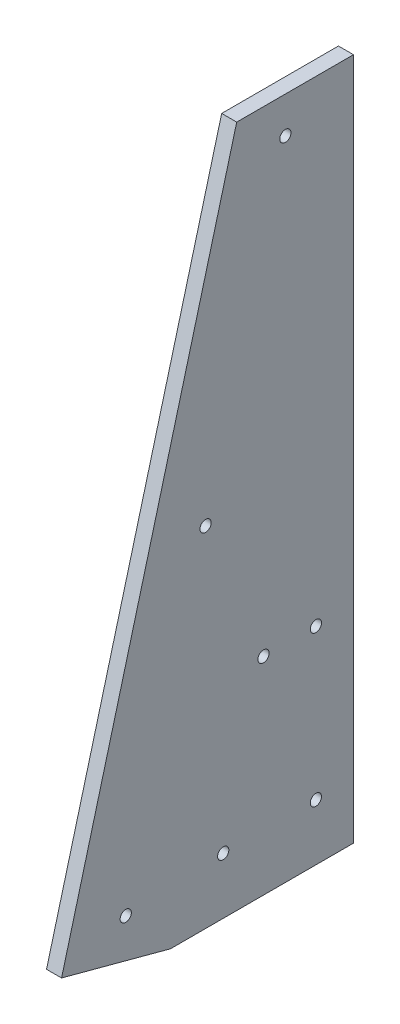
ISO-10303-21;
HEADER;
FILE_DESCRIPTION(('STEP AP214'),'2;1');
FILE_NAME('part.step','',(''),(''),'','','');
FILE_SCHEMA(('AUTOMOTIVE_DESIGN { 1 0 10303 214 1 1 1 1 }'));
ENDSEC;
DATA;
#1=APPLICATION_CONTEXT('core data for automotive mechanical design processes');
#2=APPLICATION_PROTOCOL_DEFINITION('international standard','automotive_design',2000,#1);
#3=PRODUCT_CONTEXT('',#1,'mechanical');
#4=PRODUCT('Part','Part','',(#3));
#5=PRODUCT_RELATED_PRODUCT_CATEGORY('part','',(#4));
#6=PRODUCT_DEFINITION_FORMATION('','',#4);
#7=PRODUCT_DEFINITION_CONTEXT('part definition',#1,'design');
#8=PRODUCT_DEFINITION('design','',#6,#7);
#9=PRODUCT_DEFINITION_SHAPE('','',#8);
#10=(LENGTH_UNIT() NAMED_UNIT(*) SI_UNIT(.MILLI.,.METRE.));
#11=(NAMED_UNIT(*) PLANE_ANGLE_UNIT() SI_UNIT($,.RADIAN.));
#12=(NAMED_UNIT(*) SI_UNIT($,.STERADIAN.) SOLID_ANGLE_UNIT());
#13=UNCERTAINTY_MEASURE_WITH_UNIT(LENGTH_MEASURE(1.E-05),#10,'distance_accuracy_value','');
#14=(GEOMETRIC_REPRESENTATION_CONTEXT(3) GLOBAL_UNCERTAINTY_ASSIGNED_CONTEXT((#13)) GLOBAL_UNIT_ASSIGNED_CONTEXT((#10,
#11,#12)) REPRESENTATION_CONTEXT('',''));
#15=CARTESIAN_POINT('',(0.,0.,0.));
#16=DIRECTION('',(0.,0.,1.));
#17=DIRECTION('',(1.,0.,0.));
#18=AXIS2_PLACEMENT_3D('',#15,#16,#17);
#19=CARTESIAN_POINT('',(5.08,0.,-61.8082822024453));
#20=DIRECTION('',(0.,1.,0.));
#21=DIRECTION('',(0.,0.,1.));
#22=AXIS2_PLACEMENT_3D('',#19,#20,#21);
#23=PLANE('',#22);
#24=DIRECTION('',(0.,0.,-1.));
#25=VECTOR('',#24,1.);
#26=CARTESIAN_POINT('',(0.,0.,-61.8082822024453));
#27=LINE('',#26,#25);
#28=CARTESIAN_POINT('',(0.,0.,0.));
#29=VERTEX_POINT('',#28);
#30=CARTESIAN_POINT('',(0.,0.,-61.8082822024453));
#31=VERTEX_POINT('',#30);
#32=EDGE_CURVE('E107',#29,#31,#27,.T.);
#33=ORIENTED_EDGE('',*,*,#32,.T.);
#34=DIRECTION('',(-1.,0.,0.));
#35=VECTOR('',#34,1.);
#36=CARTESIAN_POINT('',(5.08,0.,-61.8082822024453));
#37=LINE('',#36,#35);
#38=CARTESIAN_POINT('',(5.08,0.,-61.8082822024453));
#39=VERTEX_POINT('',#38);
#40=EDGE_CURVE('E11',#39,#31,#37,.T.);
#41=ORIENTED_EDGE('',*,*,#40,.F.);
#42=DIRECTION('',(0.,0.,-1.));
#43=VECTOR('',#42,1.);
#44=CARTESIAN_POINT('',(5.08,0.,-61.8082822024453));
#45=LINE('',#44,#43);
#46=CARTESIAN_POINT('',(5.08,0.,0.));
#47=VERTEX_POINT('',#46);
#48=EDGE_CURVE('E116',#47,#39,#45,.T.);
#49=ORIENTED_EDGE('',*,*,#48,.F.);
#50=DIRECTION('',(-1.,0.,0.));
#51=VECTOR('',#50,1.);
#52=CARTESIAN_POINT('',(5.08,0.,0.));
#53=LINE('',#52,#51);
#54=EDGE_CURVE('E103',#47,#29,#53,.T.);
#55=ORIENTED_EDGE('',*,*,#54,.T.);
#56=EDGE_LOOP('',(#33,#41,#49,#55));
#57=FACE_BOUND('',#56,.T.);
#58=ADVANCED_FACE('F33',(#57),#23,.F.);
#59=CARTESIAN_POINT('',(5.08,230.671649508087,-61.8082822024453));
#60=DIRECTION('',(0.,0.,1.));
#61=DIRECTION('',(0.,-1.,0.));
#62=AXIS2_PLACEMENT_3D('',#59,#60,#61);
#63=PLANE('',#62);
#64=DIRECTION('',(0.,1.,0.));
#65=VECTOR('',#64,1.);
#66=CARTESIAN_POINT('',(0.,230.671649508087,-61.8082822024453));
#67=LINE('',#66,#65);
#68=CARTESIAN_POINT('',(0.,230.671649508087,-61.8082822024453));
#69=VERTEX_POINT('',#68);
#70=EDGE_CURVE('E110',#31,#69,#67,.T.);
#71=ORIENTED_EDGE('',*,*,#70,.T.);
#72=DIRECTION('',(-1.,0.,0.));
#73=VECTOR('',#72,1.);
#74=CARTESIAN_POINT('',(5.08,230.671649508087,-61.8082822024453));
#75=LINE('',#74,#73);
#76=CARTESIAN_POINT('',(5.08,230.671649508087,-61.8082822024453));
#77=VERTEX_POINT('',#76);
#78=EDGE_CURVE('E41',#77,#69,#75,.T.);
#79=ORIENTED_EDGE('',*,*,#78,.F.);
#80=DIRECTION('',(0.,1.,0.));
#81=VECTOR('',#80,1.);
#82=CARTESIAN_POINT('',(5.08,230.671649508087,-61.8082822024453));
#83=LINE('',#82,#81);
#84=EDGE_CURVE('E83',#39,#77,#83,.T.);
#85=ORIENTED_EDGE('',*,*,#84,.F.);
#86=ORIENTED_EDGE('',*,*,#40,.T.);
#87=EDGE_LOOP('',(#71,#79,#85,#86));
#88=FACE_BOUND('',#87,.T.);
#89=ADVANCED_FACE('F136',(#88),#63,.F.);
#90=CARTESIAN_POINT('',(5.08,230.671649508087,-22.3642597288212));
#91=DIRECTION('',(0.,-1.,0.));
#92=DIRECTION('',(0.,0.,-1.));
#93=AXIS2_PLACEMENT_3D('',#90,#91,#92);
#94=PLANE('',#93);
#95=DIRECTION('',(0.,0.,1.));
#96=VECTOR('',#95,1.);
#97=CARTESIAN_POINT('',(0.,230.671649508087,-22.3642597288212));
#98=LINE('',#97,#96);
#99=CARTESIAN_POINT('',(0.,230.671649508087,-22.3642597288212));
#100=VERTEX_POINT('',#99);
#101=EDGE_CURVE('E98',#69,#100,#98,.T.);
#102=ORIENTED_EDGE('',*,*,#101,.T.);
#103=DIRECTION('',(-1.,0.,0.));
#104=VECTOR('',#103,1.);
#105=CARTESIAN_POINT('',(5.08,230.671649508087,-22.3642597288212));
#106=LINE('',#105,#104);
#107=CARTESIAN_POINT('',(5.08,230.671649508087,-22.3642597288212));
#108=VERTEX_POINT('',#107);
#109=EDGE_CURVE('E95',#108,#100,#106,.T.);
#110=ORIENTED_EDGE('',*,*,#109,.F.);
#111=DIRECTION('',(0.,0.,1.));
#112=VECTOR('',#111,1.);
#113=CARTESIAN_POINT('',(5.08,230.671649508087,-22.3642597288212));
#114=LINE('',#113,#112);
#115=EDGE_CURVE('E87',#77,#108,#114,.T.);
#116=ORIENTED_EDGE('',*,*,#115,.F.);
#117=ORIENTED_EDGE('',*,*,#78,.T.);
#118=EDGE_LOOP('',(#102,#110,#116,#117));
#119=FACE_BOUND('',#118,.T.);
#120=ADVANCED_FACE('F96',(#119),#94,.F.);
#121=CARTESIAN_POINT('',(5.08,9.86100561840579,36.8017739816136));
#122=DIRECTION('',(0.,-0.258819045102514,-0.96592582628907));
#123=DIRECTION('',(0.,0.96592582628907,-0.258819045102514));
#124=AXIS2_PLACEMENT_3D('',#121,#122,#123);
#125=PLANE('',#124);
#126=DIRECTION('',(0.,-0.96592582628907,0.258819045102514));
#127=VECTOR('',#126,1.);
#128=CARTESIAN_POINT('',(0.,9.86100561840579,36.8017739816136));
#129=LINE('',#128,#127);
#130=CARTESIAN_POINT('',(0.,9.86100561840579,36.8017739816136));
#131=VERTEX_POINT('',#130);
#132=EDGE_CURVE('E69',#100,#131,#129,.T.);
#133=ORIENTED_EDGE('',*,*,#132,.T.);
#134=DIRECTION('',(-1.,0.,0.));
#135=VECTOR('',#134,1.);
#136=CARTESIAN_POINT('',(5.08,9.86100561840579,36.8017739816136));
#137=LINE('',#136,#135);
#138=CARTESIAN_POINT('',(5.08,9.86100561840579,36.8017739816136));
#139=VERTEX_POINT('',#138);
#140=EDGE_CURVE('E99',#139,#131,#137,.T.);
#141=ORIENTED_EDGE('',*,*,#140,.F.);
#142=DIRECTION('',(0.,-0.96592582628907,0.258819045102514));
#143=VECTOR('',#142,1.);
#144=CARTESIAN_POINT('',(5.08,9.86100561840579,36.8017739816136));
#145=LINE('',#144,#143);
#146=EDGE_CURVE('E91',#108,#139,#145,.T.);
#147=ORIENTED_EDGE('',*,*,#146,.F.);
#148=ORIENTED_EDGE('',*,*,#109,.T.);
#149=EDGE_LOOP('',(#133,#141,#147,#148));
#150=FACE_BOUND('',#149,.T.);
#151=ADVANCED_FACE('F101',(#150),#125,.F.);
#152=CARTESIAN_POINT('',(5.08,0.,0.));
#153=DIRECTION('',(0.,0.96592582628907,-0.258819045102514));
#154=DIRECTION('',(0.,0.258819045102514,0.96592582628907));
#155=AXIS2_PLACEMENT_3D('',#152,#153,#154);
#156=PLANE('',#155);
#157=DIRECTION('',(0.,-0.258819045102514,-0.96592582628907));
#158=VECTOR('',#157,1.);
#159=CARTESIAN_POINT('',(0.,0.,0.));
#160=LINE('',#159,#158);
#161=EDGE_CURVE('E75',#131,#29,#160,.T.);
#162=ORIENTED_EDGE('',*,*,#161,.T.);
#163=ORIENTED_EDGE('',*,*,#54,.F.);
#164=DIRECTION('',(0.,-0.258819045102514,-0.96592582628907));
#165=VECTOR('',#164,1.);
#166=CARTESIAN_POINT('',(5.08,0.,0.));
#167=LINE('',#166,#165);
#168=EDGE_CURVE('E49',#139,#47,#167,.T.);
#169=ORIENTED_EDGE('',*,*,#168,.F.);
#170=ORIENTED_EDGE('',*,*,#140,.T.);
#171=EDGE_LOOP('',(#162,#163,#169,#170));
#172=FACE_BOUND('',#171,.T.);
#173=ADVANCED_FACE('F124',(#172),#156,.F.);
#174=CARTESIAN_POINT('',(5.08,0.,0.));
#175=DIRECTION('',(1.,0.,0.));
#176=DIRECTION('',(0.,0.,-1.));
#177=AXIS2_PLACEMENT_3D('',#174,#175,#176);
#178=PLANE('',#177);
#179=CARTESIAN_POINT('',(5.08,218.404391514216,-38.7992690928313));
#180=DIRECTION('',(1.,0.,0.));
#181=DIRECTION('',(0.,0.,-1.));
#182=AXIS2_PLACEMENT_3D('',#179,#180,#181);
#183=CIRCLE('',#182,1.89864999999997);
#184=CARTESIAN_POINT('',(5.08,218.404391514216,-40.6979190928313));
#185=VERTEX_POINT('',#184);
#186=EDGE_CURVE('E248',#185,#185,#183,.T.);
#187=ORIENTED_EDGE('',*,*,#186,.F.);
#188=EDGE_LOOP('',(#187));
#189=FACE_BOUND('',#188,.T.);
#190=CARTESIAN_POINT('',(5.08,117.801076158645,-11.8426919874132));
#191=DIRECTION('',(1.,0.,0.));
#192=DIRECTION('',(0.,0.,-1.));
#193=AXIS2_PLACEMENT_3D('',#190,#191,#192);
#194=CIRCLE('',#193,1.89864999999999);
#195=CARTESIAN_POINT('',(5.08,117.801076158645,-13.7413419874132));
#196=VERTEX_POINT('',#195);
#197=EDGE_CURVE('E250',#196,#196,#194,.T.);
#198=ORIENTED_EDGE('',*,*,#197,.F.);
#199=EDGE_LOOP('',(#198));
#200=FACE_BOUND('',#199,.T.);
#201=CARTESIAN_POINT('',(5.08,17.1977608030741,15.1138851180049));
#202=DIRECTION('',(1.,0.,0.));
#203=DIRECTION('',(0.,0.,-1.));
#204=AXIS2_PLACEMENT_3D('',#201,#202,#203);
#205=CIRCLE('',#204,1.89864999999999);
#206=CARTESIAN_POINT('',(5.08,17.1977608030741,13.2152351180049));
#207=VERTEX_POINT('',#206);
#208=EDGE_CURVE('E258',#207,#207,#205,.T.);
#209=ORIENTED_EDGE('',*,*,#208,.F.);
#210=EDGE_LOOP('',(#209));
#211=FACE_BOUND('',#210,.T.);
#212=CARTESIAN_POINT('',(5.08,19.05,-49.1082822024453));
#213=DIRECTION('',(1.,0.,0.));
#214=DIRECTION('',(0.,0.,-1.));
#215=AXIS2_PLACEMENT_3D('',#212,#213,#214);
#216=CIRCLE('',#215,1.89864999999999);
#217=CARTESIAN_POINT('',(5.08,19.05,-51.0069322024453));
#218=VERTEX_POINT('',#217);
#219=EDGE_CURVE('E264',#218,#218,#216,.T.);
#220=ORIENTED_EDGE('',*,*,#219,.F.);
#221=EDGE_LOOP('',(#220));
#222=FACE_BOUND('',#221,.T.);
#223=CARTESIAN_POINT('',(5.08,19.05,-17.8044321158127));
#224=DIRECTION('',(1.,0.,0.));
#225=DIRECTION('',(0.,0.,-1.));
#226=AXIS2_PLACEMENT_3D('',#223,#224,#225);
#227=CIRCLE('',#226,1.89864999999999);
#228=CARTESIAN_POINT('',(5.08,19.05,-19.7030821158127));
#229=VERTEX_POINT('',#228);
#230=EDGE_CURVE('E270',#229,#229,#227,.T.);
#231=ORIENTED_EDGE('',*,*,#230,.F.);
#232=EDGE_LOOP('',(#231));
#233=FACE_BOUND('',#232,.T.);
#234=CARTESIAN_POINT('',(5.08,69.85,-31.4162510913134));
#235=DIRECTION('',(1.,0.,0.));
#236=DIRECTION('',(0.,0.,-1.));
#237=AXIS2_PLACEMENT_3D('',#234,#235,#236);
#238=CIRCLE('',#237,1.89864999999999);
#239=CARTESIAN_POINT('',(5.08,69.85,-33.3149010913134));
#240=VERTEX_POINT('',#239);
#241=EDGE_CURVE('E276',#240,#240,#238,.T.);
#242=ORIENTED_EDGE('',*,*,#241,.F.);
#243=EDGE_LOOP('',(#242));
#244=FACE_BOUND('',#243,.T.);
#245=CARTESIAN_POINT('',(5.08,69.85,-49.1082822024453));
#246=DIRECTION('',(1.,0.,0.));
#247=DIRECTION('',(0.,0.,-1.));
#248=AXIS2_PLACEMENT_3D('',#245,#246,#247);
#249=CIRCLE('',#248,1.89864999999999);
#250=CARTESIAN_POINT('',(5.08,69.85,-51.0069322024453));
#251=VERTEX_POINT('',#250);
#252=EDGE_CURVE('E282',#251,#251,#249,.T.);
#253=ORIENTED_EDGE('',*,*,#252,.F.);
#254=EDGE_LOOP('',(#253));
#255=FACE_BOUND('',#254,.T.);
#256=ORIENTED_EDGE('',*,*,#48,.T.);
#257=ORIENTED_EDGE('',*,*,#84,.T.);
#258=ORIENTED_EDGE('',*,*,#115,.T.);
#259=ORIENTED_EDGE('',*,*,#146,.T.);
#260=ORIENTED_EDGE('',*,*,#168,.T.);
#261=EDGE_LOOP('',(#256,#257,#258,#259,#260));
#262=FACE_BOUND('',#261,.T.);
#263=ADVANCED_FACE('F89',(#189,#200,#211,#222,#233,#244,#255,#262),#178,.T.);
#264=CARTESIAN_POINT('',(0.,0.,0.));
#265=DIRECTION('',(1.,0.,0.));
#266=DIRECTION('',(0.,0.,-1.));
#267=AXIS2_PLACEMENT_3D('',#264,#265,#266);
#268=PLANE('',#267);
#269=CARTESIAN_POINT('',(0.,218.404391514216,-38.7992690928313));
#270=DIRECTION('',(1.,0.,0.));
#271=DIRECTION('',(0.,0.,-1.));
#272=AXIS2_PLACEMENT_3D('',#269,#270,#271);
#273=CIRCLE('',#272,1.89864999999997);
#274=CARTESIAN_POINT('',(0.,218.404391514216,-40.6979190928313));
#275=VERTEX_POINT('',#274);
#276=EDGE_CURVE('E245',#275,#275,#273,.T.);
#277=ORIENTED_EDGE('',*,*,#276,.T.);
#278=EDGE_LOOP('',(#277));
#279=FACE_BOUND('',#278,.T.);
#280=CARTESIAN_POINT('',(0.,117.801076158645,-11.8426919874132));
#281=DIRECTION('',(1.,0.,0.));
#282=DIRECTION('',(0.,0.,-1.));
#283=AXIS2_PLACEMENT_3D('',#280,#281,#282);
#284=CIRCLE('',#283,1.89864999999999);
#285=CARTESIAN_POINT('',(0.,117.801076158645,-13.7413419874132));
#286=VERTEX_POINT('',#285);
#287=EDGE_CURVE('E255',#286,#286,#284,.T.);
#288=ORIENTED_EDGE('',*,*,#287,.T.);
#289=EDGE_LOOP('',(#288));
#290=FACE_BOUND('',#289,.T.);
#291=CARTESIAN_POINT('',(0.,17.1977608030741,15.1138851180049));
#292=DIRECTION('',(1.,0.,0.));
#293=DIRECTION('',(0.,0.,-1.));
#294=AXIS2_PLACEMENT_3D('',#291,#292,#293);
#295=CIRCLE('',#294,1.89864999999999);
#296=CARTESIAN_POINT('',(0.,17.1977608030741,13.2152351180049));
#297=VERTEX_POINT('',#296);
#298=EDGE_CURVE('E261',#297,#297,#295,.T.);
#299=ORIENTED_EDGE('',*,*,#298,.T.);
#300=EDGE_LOOP('',(#299));
#301=FACE_BOUND('',#300,.T.);
#302=CARTESIAN_POINT('',(0.,19.05,-49.1082822024453));
#303=DIRECTION('',(1.,0.,0.));
#304=DIRECTION('',(0.,0.,-1.));
#305=AXIS2_PLACEMENT_3D('',#302,#303,#304);
#306=CIRCLE('',#305,1.89864999999999);
#307=CARTESIAN_POINT('',(0.,19.05,-51.0069322024453));
#308=VERTEX_POINT('',#307);
#309=EDGE_CURVE('E267',#308,#308,#306,.T.);
#310=ORIENTED_EDGE('',*,*,#309,.T.);
#311=EDGE_LOOP('',(#310));
#312=FACE_BOUND('',#311,.T.);
#313=CARTESIAN_POINT('',(0.,19.05,-17.8044321158127));
#314=DIRECTION('',(1.,0.,0.));
#315=DIRECTION('',(0.,0.,-1.));
#316=AXIS2_PLACEMENT_3D('',#313,#314,#315);
#317=CIRCLE('',#316,1.89864999999999);
#318=CARTESIAN_POINT('',(0.,19.05,-19.7030821158127));
#319=VERTEX_POINT('',#318);
#320=EDGE_CURVE('E273',#319,#319,#317,.T.);
#321=ORIENTED_EDGE('',*,*,#320,.T.);
#322=EDGE_LOOP('',(#321));
#323=FACE_BOUND('',#322,.T.);
#324=CARTESIAN_POINT('',(0.,69.85,-31.4162510913134));
#325=DIRECTION('',(1.,0.,0.));
#326=DIRECTION('',(0.,0.,-1.));
#327=AXIS2_PLACEMENT_3D('',#324,#325,#326);
#328=CIRCLE('',#327,1.89864999999999);
#329=CARTESIAN_POINT('',(0.,69.85,-33.3149010913134));
#330=VERTEX_POINT('',#329);
#331=EDGE_CURVE('E279',#330,#330,#328,.T.);
#332=ORIENTED_EDGE('',*,*,#331,.T.);
#333=EDGE_LOOP('',(#332));
#334=FACE_BOUND('',#333,.T.);
#335=CARTESIAN_POINT('',(0.,69.85,-49.1082822024453));
#336=DIRECTION('',(1.,0.,0.));
#337=DIRECTION('',(0.,0.,-1.));
#338=AXIS2_PLACEMENT_3D('',#335,#336,#337);
#339=CIRCLE('',#338,1.89864999999999);
#340=CARTESIAN_POINT('',(0.,69.85,-51.0069322024453));
#341=VERTEX_POINT('',#340);
#342=EDGE_CURVE('E111',#341,#341,#339,.T.);
#343=ORIENTED_EDGE('',*,*,#342,.T.);
#344=EDGE_LOOP('',(#343));
#345=FACE_BOUND('',#344,.T.);
#346=ORIENTED_EDGE('',*,*,#32,.F.);
#347=ORIENTED_EDGE('',*,*,#161,.F.);
#348=ORIENTED_EDGE('',*,*,#132,.F.);
#349=ORIENTED_EDGE('',*,*,#101,.F.);
#350=ORIENTED_EDGE('',*,*,#70,.F.);
#351=EDGE_LOOP('',(#346,#347,#348,#349,#350));
#352=FACE_BOUND('',#351,.T.);
#353=ADVANCED_FACE('F120',(#279,#290,#301,#312,#323,#334,#345,#352),#268,.F.);
#354=CARTESIAN_POINT('',(5.08,69.85,-49.1082822024453));
#355=DIRECTION('',(1.,0.,0.));
#356=DIRECTION('',(0.,0.,-1.));
#357=AXIS2_PLACEMENT_3D('',#354,#355,#356);
#358=CYLINDRICAL_SURFACE('',#357,1.89864999999999);
#359=ORIENTED_EDGE('',*,*,#342,.F.);
#360=EDGE_LOOP('',(#359));
#361=FACE_BOUND('',#360,.T.);
#362=ORIENTED_EDGE('',*,*,#252,.T.);
#363=EDGE_LOOP('',(#362));
#364=FACE_BOUND('',#363,.T.);
#365=ADVANCED_FACE('F169',(#361,#364),#358,.F.);
#366=CARTESIAN_POINT('',(5.08,69.85,-31.4162510913134));
#367=DIRECTION('',(1.,0.,0.));
#368=DIRECTION('',(0.,0.,-1.));
#369=AXIS2_PLACEMENT_3D('',#366,#367,#368);
#370=CYLINDRICAL_SURFACE('',#369,1.89864999999999);
#371=ORIENTED_EDGE('',*,*,#331,.F.);
#372=EDGE_LOOP('',(#371));
#373=FACE_BOUND('',#372,.T.);
#374=ORIENTED_EDGE('',*,*,#241,.T.);
#375=EDGE_LOOP('',(#374));
#376=FACE_BOUND('',#375,.T.);
#377=ADVANCED_FACE('F178',(#373,#376),#370,.F.);
#378=CARTESIAN_POINT('',(5.08,19.05,-17.8044321158127));
#379=DIRECTION('',(1.,0.,0.));
#380=DIRECTION('',(0.,0.,-1.));
#381=AXIS2_PLACEMENT_3D('',#378,#379,#380);
#382=CYLINDRICAL_SURFACE('',#381,1.89864999999999);
#383=ORIENTED_EDGE('',*,*,#320,.F.);
#384=EDGE_LOOP('',(#383));
#385=FACE_BOUND('',#384,.T.);
#386=ORIENTED_EDGE('',*,*,#230,.T.);
#387=EDGE_LOOP('',(#386));
#388=FACE_BOUND('',#387,.T.);
#389=ADVANCED_FACE('F188',(#385,#388),#382,.F.);
#390=CARTESIAN_POINT('',(5.08,19.05,-49.1082822024453));
#391=DIRECTION('',(1.,0.,0.));
#392=DIRECTION('',(0.,0.,-1.));
#393=AXIS2_PLACEMENT_3D('',#390,#391,#392);
#394=CYLINDRICAL_SURFACE('',#393,1.89864999999999);
#395=ORIENTED_EDGE('',*,*,#309,.F.);
#396=EDGE_LOOP('',(#395));
#397=FACE_BOUND('',#396,.T.);
#398=ORIENTED_EDGE('',*,*,#219,.T.);
#399=EDGE_LOOP('',(#398));
#400=FACE_BOUND('',#399,.T.);
#401=ADVANCED_FACE('F198',(#397,#400),#394,.F.);
#402=CARTESIAN_POINT('',(5.08,17.1977608030741,15.1138851180049));
#403=DIRECTION('',(1.,0.,0.));
#404=DIRECTION('',(0.,0.,-1.));
#405=AXIS2_PLACEMENT_3D('',#402,#403,#404);
#406=CYLINDRICAL_SURFACE('',#405,1.89864999999999);
#407=ORIENTED_EDGE('',*,*,#298,.F.);
#408=EDGE_LOOP('',(#407));
#409=FACE_BOUND('',#408,.T.);
#410=ORIENTED_EDGE('',*,*,#208,.T.);
#411=EDGE_LOOP('',(#410));
#412=FACE_BOUND('',#411,.T.);
#413=ADVANCED_FACE('F208',(#409,#412),#406,.F.);
#414=CARTESIAN_POINT('',(5.08,117.801076158645,-11.8426919874132));
#415=DIRECTION('',(1.,0.,0.));
#416=DIRECTION('',(0.,0.,-1.));
#417=AXIS2_PLACEMENT_3D('',#414,#415,#416);
#418=CYLINDRICAL_SURFACE('',#417,1.89864999999999);
#419=ORIENTED_EDGE('',*,*,#287,.F.);
#420=EDGE_LOOP('',(#419));
#421=FACE_BOUND('',#420,.T.);
#422=ORIENTED_EDGE('',*,*,#197,.T.);
#423=EDGE_LOOP('',(#422));
#424=FACE_BOUND('',#423,.T.);
#425=ADVANCED_FACE('F218',(#421,#424),#418,.F.);
#426=CARTESIAN_POINT('',(5.08,218.404391514216,-38.7992690928313));
#427=DIRECTION('',(1.,0.,0.));
#428=DIRECTION('',(0.,0.,-1.));
#429=AXIS2_PLACEMENT_3D('',#426,#427,#428);
#430=CYLINDRICAL_SURFACE('',#429,1.89864999999997);
#431=ORIENTED_EDGE('',*,*,#276,.F.);
#432=EDGE_LOOP('',(#431));
#433=FACE_BOUND('',#432,.T.);
#434=ORIENTED_EDGE('',*,*,#186,.T.);
#435=EDGE_LOOP('',(#434));
#436=FACE_BOUND('',#435,.T.);
#437=ADVANCED_FACE('F228',(#433,#436),#430,.F.);
#438=CLOSED_SHELL('',(#58,#89,#120,#151,#173,#263,#353,#365,#377,#389,#401,#413,#425,#437));
#439=MANIFOLD_SOLID_BREP('B2',#438);
#440=ADVANCED_BREP_SHAPE_REPRESENTATION('',(#18,#439),#14);
#441=SHAPE_DEFINITION_REPRESENTATION(#9,#440);
ENDSEC;
END-ISO-10303-21;
